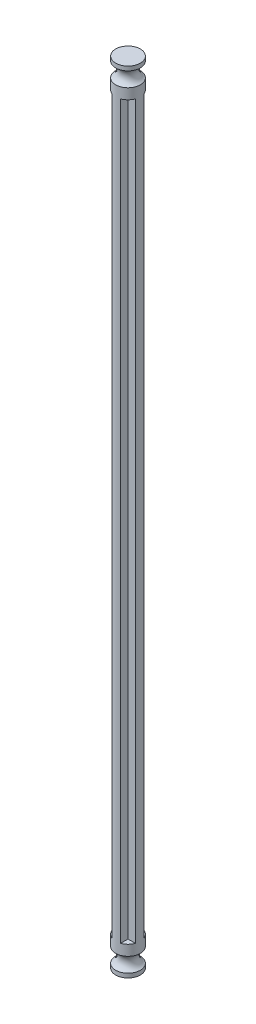
ISO-10303-21;
HEADER;
FILE_DESCRIPTION(('STEP AP214'),'2;1');
FILE_NAME('part.step','',(''),(''),'','','');
FILE_SCHEMA(('AUTOMOTIVE_DESIGN { 1 0 10303 214 1 1 1 1 }'));
ENDSEC;
DATA;
#1=APPLICATION_CONTEXT('core data for automotive mechanical design processes');
#2=APPLICATION_PROTOCOL_DEFINITION('international standard','automotive_design',2000,#1);
#3=PRODUCT_CONTEXT('',#1,'mechanical');
#4=PRODUCT('Part','Part','',(#3));
#5=PRODUCT_RELATED_PRODUCT_CATEGORY('part','',(#4));
#6=PRODUCT_DEFINITION_FORMATION('','',#4);
#7=PRODUCT_DEFINITION_CONTEXT('part definition',#1,'design');
#8=PRODUCT_DEFINITION('design','',#6,#7);
#9=PRODUCT_DEFINITION_SHAPE('','',#8);
#10=(LENGTH_UNIT() NAMED_UNIT(*) SI_UNIT(.MILLI.,.METRE.));
#11=(NAMED_UNIT(*) PLANE_ANGLE_UNIT() SI_UNIT($,.RADIAN.));
#12=(NAMED_UNIT(*) SI_UNIT($,.STERADIAN.) SOLID_ANGLE_UNIT());
#13=UNCERTAINTY_MEASURE_WITH_UNIT(LENGTH_MEASURE(1.E-05),#10,'distance_accuracy_value','');
#14=(GEOMETRIC_REPRESENTATION_CONTEXT(3) GLOBAL_UNCERTAINTY_ASSIGNED_CONTEXT((#13)) GLOBAL_UNIT_ASSIGNED_CONTEXT((#10,
#11,#12)) REPRESENTATION_CONTEXT('',''));
#15=CARTESIAN_POINT('',(0.,0.,0.));
#16=DIRECTION('',(0.,0.,1.));
#17=DIRECTION('',(1.,0.,0.));
#18=AXIS2_PLACEMENT_3D('',#15,#16,#17);
#19=CARTESIAN_POINT('',(1.,175.28,1.));
#20=DIRECTION('',(-1.,0.,0.));
#21=DIRECTION('',(0.,0.,1.));
#22=AXIS2_PLACEMENT_3D('',#19,#20,#21);
#23=PLANE('',#22);
#24=DIRECTION('',(0.,0.,-1.));
#25=VECTOR('',#24,1.);
#26=CARTESIAN_POINT('',(1.,0.,1.));
#27=LINE('',#26,#25);
#28=CARTESIAN_POINT('',(1.,0.,2.77533781727558));
#29=VERTEX_POINT('',#28);
#30=CARTESIAN_POINT('',(1.,0.,1.));
#31=VERTEX_POINT('',#30);
#32=EDGE_CURVE('E122',#29,#31,#27,.T.);
#33=ORIENTED_EDGE('',*,*,#32,.T.);
#34=DIRECTION('',(0.,-1.,0.));
#35=VECTOR('',#34,1.);
#36=CARTESIAN_POINT('',(1.,175.28,1.));
#37=LINE('',#36,#35);
#38=CARTESIAN_POINT('',(1.,175.28,1.));
#39=VERTEX_POINT('',#38);
#40=EDGE_CURVE('E11',#39,#31,#37,.T.);
#41=ORIENTED_EDGE('',*,*,#40,.F.);
#42=DIRECTION('',(0.,0.,-1.));
#43=VECTOR('',#42,1.);
#44=CARTESIAN_POINT('',(1.,175.28,1.));
#45=LINE('',#44,#43);
#46=CARTESIAN_POINT('',(0.999999999999999,175.28,2.77533781727558));
#47=VERTEX_POINT('',#46);
#48=EDGE_CURVE('E139',#47,#39,#45,.T.);
#49=ORIENTED_EDGE('',*,*,#48,.F.);
#50=DIRECTION('',(0.,-1.,0.));
#51=VECTOR('',#50,1.);
#52=CARTESIAN_POINT('',(0.999999999999999,175.28,2.77533781727558));
#53=LINE('',#52,#51);
#54=EDGE_CURVE('E52',#47,#29,#53,.T.);
#55=ORIENTED_EDGE('',*,*,#54,.T.);
#56=EDGE_LOOP('',(#33,#41,#49,#55));
#57=FACE_BOUND('',#56,.T.);
#58=ADVANCED_FACE('F37',(#57),#23,.F.);
#59=CARTESIAN_POINT('',(1.,175.28,1.));
#60=DIRECTION('',(0.,0.,-1.));
#61=DIRECTION('',(-1.,0.,0.));
#62=AXIS2_PLACEMENT_3D('',#59,#60,#61);
#63=PLANE('',#62);
#64=DIRECTION('',(1.,0.,0.));
#65=VECTOR('',#64,1.);
#66=CARTESIAN_POINT('',(1.,0.,1.));
#67=LINE('',#66,#65);
#68=CARTESIAN_POINT('',(2.77533781727558,0.,1.));
#69=VERTEX_POINT('',#68);
#70=EDGE_CURVE('E126',#31,#69,#67,.T.);
#71=ORIENTED_EDGE('',*,*,#70,.T.);
#72=DIRECTION('',(0.,-1.,0.));
#73=VECTOR('',#72,1.);
#74=CARTESIAN_POINT('',(2.77533781727558,175.28,1.));
#75=LINE('',#74,#73);
#76=CARTESIAN_POINT('',(2.77533781727558,175.28,1.));
#77=VERTEX_POINT('',#76);
#78=EDGE_CURVE('E45',#77,#69,#75,.T.);
#79=ORIENTED_EDGE('',*,*,#78,.F.);
#80=DIRECTION('',(1.,0.,0.));
#81=VECTOR('',#80,1.);
#82=CARTESIAN_POINT('',(1.,175.28,1.));
#83=LINE('',#82,#81);
#84=EDGE_CURVE('E213',#39,#77,#83,.T.);
#85=ORIENTED_EDGE('',*,*,#84,.F.);
#86=ORIENTED_EDGE('',*,*,#40,.T.);
#87=EDGE_LOOP('',(#71,#79,#85,#86));
#88=FACE_BOUND('',#87,.T.);
#89=ADVANCED_FACE('F277',(#88),#63,.F.);
#90=CARTESIAN_POINT('',(1.,175.28,-1.));
#91=DIRECTION('',(0.,0.,1.));
#92=DIRECTION('',(1.,0.,0.));
#93=AXIS2_PLACEMENT_3D('',#90,#91,#92);
#94=PLANE('',#93);
#95=DIRECTION('',(-1.,0.,0.));
#96=VECTOR('',#95,1.);
#97=CARTESIAN_POINT('',(1.,0.,-1.));
#98=LINE('',#97,#96);
#99=CARTESIAN_POINT('',(2.77533781727558,0.,-1.));
#100=VERTEX_POINT('',#99);
#101=CARTESIAN_POINT('',(1.,0.,-1.));
#102=VERTEX_POINT('',#101);
#103=EDGE_CURVE('E180',#100,#102,#98,.T.);
#104=ORIENTED_EDGE('',*,*,#103,.T.);
#105=DIRECTION('',(0.,-1.,0.));
#106=VECTOR('',#105,1.);
#107=CARTESIAN_POINT('',(1.,175.28,-1.));
#108=LINE('',#107,#106);
#109=CARTESIAN_POINT('',(1.,175.28,-1.));
#110=VERTEX_POINT('',#109);
#111=EDGE_CURVE('E171',#110,#102,#108,.T.);
#112=ORIENTED_EDGE('',*,*,#111,.F.);
#113=DIRECTION('',(-1.,0.,0.));
#114=VECTOR('',#113,1.);
#115=CARTESIAN_POINT('',(1.,175.28,-1.));
#116=LINE('',#115,#114);
#117=CARTESIAN_POINT('',(2.77533781727558,175.28,-1.));
#118=VERTEX_POINT('',#117);
#119=EDGE_CURVE('E182',#118,#110,#116,.T.);
#120=ORIENTED_EDGE('',*,*,#119,.F.);
#121=DIRECTION('',(0.,-1.,0.));
#122=VECTOR('',#121,1.);
#123=CARTESIAN_POINT('',(2.77533781727558,175.28,-1.));
#124=LINE('',#123,#122);
#125=EDGE_CURVE('E174',#118,#100,#124,.T.);
#126=ORIENTED_EDGE('',*,*,#125,.T.);
#127=EDGE_LOOP('',(#104,#112,#120,#126));
#128=FACE_BOUND('',#127,.T.);
#129=ADVANCED_FACE('F179',(#128),#94,.F.);
#130=CARTESIAN_POINT('',(1.,175.28,-1.));
#131=DIRECTION('',(-1.,0.,0.));
#132=DIRECTION('',(0.,0.,1.));
#133=AXIS2_PLACEMENT_3D('',#130,#131,#132);
#134=PLANE('',#133);
#135=DIRECTION('',(0.,0.,-1.));
#136=VECTOR('',#135,1.);
#137=CARTESIAN_POINT('',(1.,0.,-1.));
#138=LINE('',#137,#136);
#139=CARTESIAN_POINT('',(0.999999999999999,0.,-2.77533781727558));
#140=VERTEX_POINT('',#139);
#141=EDGE_CURVE('E230',#102,#140,#138,.T.);
#142=ORIENTED_EDGE('',*,*,#141,.T.);
#143=DIRECTION('',(0.,-1.,0.));
#144=VECTOR('',#143,1.);
#145=CARTESIAN_POINT('',(1.,175.28,-2.77533781727558));
#146=LINE('',#145,#144);
#147=CARTESIAN_POINT('',(1.,175.28,-2.77533781727558));
#148=VERTEX_POINT('',#147);
#149=EDGE_CURVE('E168',#148,#140,#146,.T.);
#150=ORIENTED_EDGE('',*,*,#149,.F.);
#151=DIRECTION('',(0.,0.,-1.));
#152=VECTOR('',#151,1.);
#153=CARTESIAN_POINT('',(1.,175.28,-1.));
#154=LINE('',#153,#152);
#155=EDGE_CURVE('E217',#110,#148,#154,.T.);
#156=ORIENTED_EDGE('',*,*,#155,.F.);
#157=ORIENTED_EDGE('',*,*,#111,.T.);
#158=EDGE_LOOP('',(#142,#150,#156,#157));
#159=FACE_BOUND('',#158,.T.);
#160=ADVANCED_FACE('F266',(#159),#134,.F.);
#161=CARTESIAN_POINT('',(-1.,175.28,-1.));
#162=DIRECTION('',(1.,0.,0.));
#163=DIRECTION('',(0.,0.,-1.));
#164=AXIS2_PLACEMENT_3D('',#161,#162,#163);
#165=PLANE('',#164);
#166=DIRECTION('',(0.,0.,1.));
#167=VECTOR('',#166,1.);
#168=CARTESIAN_POINT('',(-1.,0.,-1.));
#169=LINE('',#168,#167);
#170=CARTESIAN_POINT('',(-1.,0.,-2.77533781727558));
#171=VERTEX_POINT('',#170);
#172=CARTESIAN_POINT('',(-1.,0.,-1.));
#173=VERTEX_POINT('',#172);
#174=EDGE_CURVE('E232',#171,#173,#169,.T.);
#175=ORIENTED_EDGE('',*,*,#174,.T.);
#176=DIRECTION('',(0.,-1.,0.));
#177=VECTOR('',#176,1.);
#178=CARTESIAN_POINT('',(-1.,175.28,-1.));
#179=LINE('',#178,#177);
#180=CARTESIAN_POINT('',(-1.,175.28,-1.));
#181=VERTEX_POINT('',#180);
#182=EDGE_CURVE('E162',#181,#173,#179,.T.);
#183=ORIENTED_EDGE('',*,*,#182,.F.);
#184=DIRECTION('',(0.,0.,1.));
#185=VECTOR('',#184,1.);
#186=CARTESIAN_POINT('',(-1.,175.28,-1.));
#187=LINE('',#186,#185);
#188=CARTESIAN_POINT('',(-1.,175.28,-2.77533781727558));
#189=VERTEX_POINT('',#188);
#190=EDGE_CURVE('E220',#189,#181,#187,.T.);
#191=ORIENTED_EDGE('',*,*,#190,.F.);
#192=DIRECTION('',(0.,-1.,0.));
#193=VECTOR('',#192,1.);
#194=CARTESIAN_POINT('',(-1.,175.28,-2.77533781727558));
#195=LINE('',#194,#193);
#196=EDGE_CURVE('E165',#189,#171,#195,.T.);
#197=ORIENTED_EDGE('',*,*,#196,.T.);
#198=EDGE_LOOP('',(#175,#183,#191,#197));
#199=FACE_BOUND('',#198,.T.);
#200=ADVANCED_FACE('F264',(#199),#165,.F.);
#201=CARTESIAN_POINT('',(-1.,175.28,-1.));
#202=DIRECTION('',(0.,0.,1.));
#203=DIRECTION('',(1.,0.,0.));
#204=AXIS2_PLACEMENT_3D('',#201,#202,#203);
#205=PLANE('',#204);
#206=DIRECTION('',(-1.,0.,0.));
#207=VECTOR('',#206,1.);
#208=CARTESIAN_POINT('',(-1.,0.,-1.));
#209=LINE('',#208,#207);
#210=CARTESIAN_POINT('',(-2.77533781727558,0.,-1.));
#211=VERTEX_POINT('',#210);
#212=EDGE_CURVE('E235',#173,#211,#209,.T.);
#213=ORIENTED_EDGE('',*,*,#212,.T.);
#214=DIRECTION('',(0.,-1.,0.));
#215=VECTOR('',#214,1.);
#216=CARTESIAN_POINT('',(-2.77533781727558,175.28,-1.));
#217=LINE('',#216,#215);
#218=CARTESIAN_POINT('',(-2.77533781727558,175.28,-1.));
#219=VERTEX_POINT('',#218);
#220=EDGE_CURVE('E159',#219,#211,#217,.T.);
#221=ORIENTED_EDGE('',*,*,#220,.F.);
#222=DIRECTION('',(-1.,0.,0.));
#223=VECTOR('',#222,1.);
#224=CARTESIAN_POINT('',(-1.,175.28,-1.));
#225=LINE('',#224,#223);
#226=EDGE_CURVE('E223',#181,#219,#225,.T.);
#227=ORIENTED_EDGE('',*,*,#226,.F.);
#228=ORIENTED_EDGE('',*,*,#182,.T.);
#229=EDGE_LOOP('',(#213,#221,#227,#228));
#230=FACE_BOUND('',#229,.T.);
#231=ADVANCED_FACE('F260',(#230),#205,.F.);
#232=CARTESIAN_POINT('',(-1.,175.28,1.));
#233=DIRECTION('',(0.,0.,-1.));
#234=DIRECTION('',(-1.,0.,0.));
#235=AXIS2_PLACEMENT_3D('',#232,#233,#234);
#236=PLANE('',#235);
#237=DIRECTION('',(1.,0.,0.));
#238=VECTOR('',#237,1.);
#239=CARTESIAN_POINT('',(-1.,0.,1.));
#240=LINE('',#239,#238);
#241=CARTESIAN_POINT('',(-2.77533781727558,0.,1.));
#242=VERTEX_POINT('',#241);
#243=CARTESIAN_POINT('',(-1.,0.,1.));
#244=VERTEX_POINT('',#243);
#245=EDGE_CURVE('E237',#242,#244,#240,.T.);
#246=ORIENTED_EDGE('',*,*,#245,.T.);
#247=DIRECTION('',(0.,-1.,0.));
#248=VECTOR('',#247,1.);
#249=CARTESIAN_POINT('',(-1.,175.28,1.));
#250=LINE('',#249,#248);
#251=CARTESIAN_POINT('',(-1.,175.28,1.));
#252=VERTEX_POINT('',#251);
#253=EDGE_CURVE('E145',#252,#244,#250,.T.);
#254=ORIENTED_EDGE('',*,*,#253,.F.);
#255=DIRECTION('',(1.,0.,0.));
#256=VECTOR('',#255,1.);
#257=CARTESIAN_POINT('',(-1.,175.28,1.));
#258=LINE('',#257,#256);
#259=CARTESIAN_POINT('',(-2.77533781727558,175.28,0.999999999999999));
#260=VERTEX_POINT('',#259);
#261=EDGE_CURVE('E148',#260,#252,#258,.T.);
#262=ORIENTED_EDGE('',*,*,#261,.F.);
#263=DIRECTION('',(0.,-1.,0.));
#264=VECTOR('',#263,1.);
#265=CARTESIAN_POINT('',(-2.77533781727558,175.28,0.999999999999999));
#266=LINE('',#265,#264);
#267=EDGE_CURVE('E156',#260,#242,#266,.T.);
#268=ORIENTED_EDGE('',*,*,#267,.T.);
#269=EDGE_LOOP('',(#246,#254,#262,#268));
#270=FACE_BOUND('',#269,.T.);
#271=ADVANCED_FACE('F272',(#270),#236,.F.);
#272=CARTESIAN_POINT('',(-1.,175.28,1.));
#273=DIRECTION('',(1.,0.,0.));
#274=DIRECTION('',(0.,0.,-1.));
#275=AXIS2_PLACEMENT_3D('',#272,#273,#274);
#276=PLANE('',#275);
#277=DIRECTION('',(0.,0.,1.));
#278=VECTOR('',#277,1.);
#279=CARTESIAN_POINT('',(-1.,0.,1.));
#280=LINE('',#279,#278);
#281=CARTESIAN_POINT('',(-0.999999999999999,0.,2.77533781727558));
#282=VERTEX_POINT('',#281);
#283=EDGE_CURVE('E151',#244,#282,#280,.T.);
#284=ORIENTED_EDGE('',*,*,#283,.T.);
#285=DIRECTION('',(0.,-1.,0.));
#286=VECTOR('',#285,1.);
#287=CARTESIAN_POINT('',(-1.,175.28,2.77533781727558));
#288=LINE('',#287,#286);
#289=CARTESIAN_POINT('',(-0.999999999999999,175.28,2.77533781727563));
#290=VERTEX_POINT('',#289);
#291=EDGE_CURVE('E141',#290,#282,#288,.T.);
#292=ORIENTED_EDGE('',*,*,#291,.F.);
#293=DIRECTION('',(0.,0.,1.));
#294=VECTOR('',#293,1.);
#295=CARTESIAN_POINT('',(-1.,175.28,1.));
#296=LINE('',#295,#294);
#297=EDGE_CURVE('E142',#252,#290,#296,.T.);
#298=ORIENTED_EDGE('',*,*,#297,.F.);
#299=ORIENTED_EDGE('',*,*,#253,.T.);
#300=EDGE_LOOP('',(#284,#292,#298,#299));
#301=FACE_BOUND('',#300,.T.);
#302=ADVANCED_FACE('F242',(#301),#276,.F.);
#303=CARTESIAN_POINT('',(0.,175.28,0.));
#304=DIRECTION('',(0.,-1.,0.));
#305=DIRECTION('',(0.,0.,-1.));
#306=AXIS2_PLACEMENT_3D('',#303,#304,#305);
#307=CYLINDRICAL_SURFACE('',#306,2.95);
#308=CARTESIAN_POINT('',(0.,0.,0.));
#309=DIRECTION('',(0.,1.,0.));
#310=DIRECTION('',(0.,0.,1.));
#311=AXIS2_PLACEMENT_3D('',#308,#309,#310);
#312=CIRCLE('',#311,2.95);
#313=EDGE_CURVE('E124',#29,#69,#312,.T.);
#314=ORIENTED_EDGE('',*,*,#313,.F.);
#315=ORIENTED_EDGE('',*,*,#54,.F.);
#316=CARTESIAN_POINT('',(0.,175.28,0.));
#317=DIRECTION('',(0.,1.,0.));
#318=DIRECTION('',(0.,0.,1.));
#319=AXIS2_PLACEMENT_3D('',#316,#317,#318);
#320=CIRCLE('',#319,2.95000000000002);
#321=EDGE_CURVE('E129',#47,#77,#320,.T.);
#322=ORIENTED_EDGE('',*,*,#321,.T.);
#323=ORIENTED_EDGE('',*,*,#78,.T.);
#324=EDGE_LOOP('',(#314,#315,#322,#323));
#325=FACE_BOUND('',#324,.T.);
#326=EDGE_CURVE('E137',#242,#282,#312,.T.);
#327=ORIENTED_EDGE('',*,*,#326,.F.);
#328=ORIENTED_EDGE('',*,*,#267,.F.);
#329=EDGE_CURVE('E210',#260,#290,#320,.T.);
#330=ORIENTED_EDGE('',*,*,#329,.T.);
#331=ORIENTED_EDGE('',*,*,#291,.T.);
#332=EDGE_LOOP('',(#327,#328,#330,#331));
#333=FACE_BOUND('',#332,.T.);
#334=EDGE_CURVE('E191',#171,#211,#312,.T.);
#335=ORIENTED_EDGE('',*,*,#334,.F.);
#336=ORIENTED_EDGE('',*,*,#196,.F.);
#337=EDGE_CURVE('E251',#189,#219,#320,.T.);
#338=ORIENTED_EDGE('',*,*,#337,.T.);
#339=ORIENTED_EDGE('',*,*,#220,.T.);
#340=EDGE_LOOP('',(#335,#336,#338,#339));
#341=FACE_BOUND('',#340,.T.);
#342=ORIENTED_EDGE('',*,*,#149,.T.);
#343=EDGE_CURVE('E135',#100,#140,#312,.T.);
#344=ORIENTED_EDGE('',*,*,#343,.F.);
#345=ORIENTED_EDGE('',*,*,#125,.F.);
#346=EDGE_CURVE('E188',#118,#148,#320,.T.);
#347=ORIENTED_EDGE('',*,*,#346,.T.);
#348=EDGE_LOOP('',(#342,#344,#345,#347));
#349=FACE_BOUND('',#348,.T.);
#350=CARTESIAN_POINT('',(0.,177.78,0.));
#351=DIRECTION('',(0.,1.,0.));
#352=DIRECTION('',(0.,0.,1.));
#353=AXIS2_PLACEMENT_3D('',#350,#351,#352);
#354=CIRCLE('',#353,2.95000000000002);
#355=CARTESIAN_POINT('',(0.,177.78,2.95000000000004));
#356=VERTEX_POINT('',#355);
#357=EDGE_CURVE('E207',#356,#356,#354,.T.);
#358=ORIENTED_EDGE('',*,*,#357,.F.);
#359=EDGE_LOOP('',(#358));
#360=FACE_BOUND('',#359,.T.);
#361=CARTESIAN_POINT('',(0.,-2.5,0.));
#362=DIRECTION('',(0.,1.,0.));
#363=DIRECTION('',(0.,0.,1.));
#364=AXIS2_PLACEMENT_3D('',#361,#362,#363);
#365=CIRCLE('',#364,2.95);
#366=CARTESIAN_POINT('',(0.,-2.5,2.95));
#367=VERTEX_POINT('',#366);
#368=EDGE_CURVE('E134',#367,#367,#365,.T.);
#369=ORIENTED_EDGE('',*,*,#368,.T.);
#370=EDGE_LOOP('',(#369));
#371=FACE_BOUND('',#370,.T.);
#372=ADVANCED_FACE('F132',(#325,#333,#341,#349,#360,#371),#307,.T.);
#373=CARTESIAN_POINT('',(0.,175.28,0.));
#374=DIRECTION('',(0.,1.,0.));
#375=DIRECTION('',(0.,0.,1.));
#376=AXIS2_PLACEMENT_3D('',#373,#374,#375);
#377=PLANE('',#376);
#378=ORIENTED_EDGE('',*,*,#321,.F.);
#379=ORIENTED_EDGE('',*,*,#48,.T.);
#380=ORIENTED_EDGE('',*,*,#84,.T.);
#381=EDGE_LOOP('',(#378,#379,#380));
#382=FACE_BOUND('',#381,.T.);
#383=ADVANCED_FACE('F287',(#382),#377,.F.);
#384=ORIENTED_EDGE('',*,*,#346,.F.);
#385=ORIENTED_EDGE('',*,*,#119,.T.);
#386=ORIENTED_EDGE('',*,*,#155,.T.);
#387=EDGE_LOOP('',(#384,#385,#386));
#388=FACE_BOUND('',#387,.T.);
#389=ADVANCED_FACE('F289',(#388),#377,.F.);
#390=ORIENTED_EDGE('',*,*,#337,.F.);
#391=ORIENTED_EDGE('',*,*,#190,.T.);
#392=ORIENTED_EDGE('',*,*,#226,.T.);
#393=EDGE_LOOP('',(#390,#391,#392));
#394=FACE_BOUND('',#393,.T.);
#395=ADVANCED_FACE('F257',(#394),#377,.F.);
#396=ORIENTED_EDGE('',*,*,#329,.F.);
#397=ORIENTED_EDGE('',*,*,#261,.T.);
#398=ORIENTED_EDGE('',*,*,#297,.T.);
#399=EDGE_LOOP('',(#396,#397,#398));
#400=FACE_BOUND('',#399,.T.);
#401=ADVANCED_FACE('F291',(#400),#377,.F.);
#402=CARTESIAN_POINT('',(0.,179.53,0.));
#403=DIRECTION('',(0.,1.,0.));
#404=DIRECTION('',(0.,0.,1.));
#405=AXIS2_PLACEMENT_3D('',#402,#403,#404);
#406=TOROIDAL_SURFACE('',#405,3.91824583655187,2.);
#407=CARTESIAN_POINT('',(0.,181.28,0.));
#408=DIRECTION('',(0.,1.,0.));
#409=DIRECTION('',(0.,0.,1.));
#410=AXIS2_PLACEMENT_3D('',#407,#408,#409);
#411=CIRCLE('',#410,2.95000000000002);
#412=CARTESIAN_POINT('',(0.,181.28,2.95000000000004));
#413=VERTEX_POINT('',#412);
#414=EDGE_CURVE('E204',#413,#413,#411,.T.);
#415=ORIENTED_EDGE('',*,*,#414,.F.);
#416=EDGE_LOOP('',(#415));
#417=FACE_BOUND('',#416,.T.);
#418=ORIENTED_EDGE('',*,*,#357,.T.);
#419=EDGE_LOOP('',(#418));
#420=FACE_BOUND('',#419,.T.);
#421=ADVANCED_FACE('F300',(#417,#420),#406,.F.);
#422=CARTESIAN_POINT('',(0.,0.,0.));
#423=DIRECTION('',(0.,1.,0.));
#424=DIRECTION('',(0.,0.,1.));
#425=AXIS2_PLACEMENT_3D('',#422,#423,#424);
#426=CYLINDRICAL_SURFACE('',#425,2.95000000000002);
#427=CARTESIAN_POINT('',(0.,182.28,0.));
#428=DIRECTION('',(0.,1.,0.));
#429=DIRECTION('',(0.,0.,1.));
#430=AXIS2_PLACEMENT_3D('',#427,#428,#429);
#431=CIRCLE('',#430,2.95000000000002);
#432=CARTESIAN_POINT('',(0.,182.28,2.95000000000004));
#433=VERTEX_POINT('',#432);
#434=EDGE_CURVE('E201',#433,#433,#431,.T.);
#435=ORIENTED_EDGE('',*,*,#434,.F.);
#436=EDGE_LOOP('',(#435));
#437=FACE_BOUND('',#436,.T.);
#438=ORIENTED_EDGE('',*,*,#414,.T.);
#439=EDGE_LOOP('',(#438));
#440=FACE_BOUND('',#439,.T.);
#441=ADVANCED_FACE('F305',(#437,#440),#426,.T.);
#442=CARTESIAN_POINT('',(0.,182.28,0.));
#443=DIRECTION('',(0.,-1.,0.));
#444=DIRECTION('',(0.,0.,-1.));
#445=AXIS2_PLACEMENT_3D('',#442,#443,#444);
#446=PLANE('',#445);
#447=ORIENTED_EDGE('',*,*,#434,.T.);
#448=EDGE_LOOP('',(#447));
#449=FACE_BOUND('',#448,.T.);
#450=ADVANCED_FACE('F405',(#449),#446,.F.);
#451=CARTESIAN_POINT('',(0.,0.,0.));
#452=DIRECTION('',(0.,-1.,0.));
#453=DIRECTION('',(0.,0.,-1.));
#454=AXIS2_PLACEMENT_3D('',#451,#452,#453);
#455=PLANE('',#454);
#456=ORIENTED_EDGE('',*,*,#283,.F.);
#457=ORIENTED_EDGE('',*,*,#245,.F.);
#458=ORIENTED_EDGE('',*,*,#326,.T.);
#459=EDGE_LOOP('',(#456,#457,#458));
#460=FACE_BOUND('',#459,.T.);
#461=ADVANCED_FACE('F414',(#460),#455,.F.);
#462=ORIENTED_EDGE('',*,*,#212,.F.);
#463=ORIENTED_EDGE('',*,*,#174,.F.);
#464=ORIENTED_EDGE('',*,*,#334,.T.);
#465=EDGE_LOOP('',(#462,#463,#464));
#466=FACE_BOUND('',#465,.T.);
#467=ADVANCED_FACE('F262',(#466),#455,.F.);
#468=ORIENTED_EDGE('',*,*,#141,.F.);
#469=ORIENTED_EDGE('',*,*,#103,.F.);
#470=ORIENTED_EDGE('',*,*,#343,.T.);
#471=EDGE_LOOP('',(#468,#469,#470));
#472=FACE_BOUND('',#471,.T.);
#473=ADVANCED_FACE('F430',(#472),#455,.F.);
#474=ORIENTED_EDGE('',*,*,#32,.F.);
#475=ORIENTED_EDGE('',*,*,#313,.T.);
#476=ORIENTED_EDGE('',*,*,#70,.F.);
#477=EDGE_LOOP('',(#474,#475,#476));
#478=FACE_BOUND('',#477,.T.);
#479=ADVANCED_FACE('F123',(#478),#455,.F.);
#480=CARTESIAN_POINT('',(0.,-7.,0.));
#481=DIRECTION('',(0.,1.,0.));
#482=DIRECTION('',(0.,0.,1.));
#483=AXIS2_PLACEMENT_3D('',#480,#481,#482);
#484=PLANE('',#483);
#485=CARTESIAN_POINT('',(0.,-7.,0.));
#486=DIRECTION('',(0.,1.,0.));
#487=DIRECTION('',(0.,0.,1.));
#488=AXIS2_PLACEMENT_3D('',#485,#486,#487);
#489=CIRCLE('',#488,2.95);
#490=CARTESIAN_POINT('',(0.,-7.,2.95));
#491=VERTEX_POINT('',#490);
#492=EDGE_CURVE('E198',#491,#491,#489,.T.);
#493=ORIENTED_EDGE('',*,*,#492,.F.);
#494=EDGE_LOOP('',(#493));
#495=FACE_BOUND('',#494,.T.);
#496=ADVANCED_FACE('F443',(#495),#484,.F.);
#497=CARTESIAN_POINT('',(0.,0.,0.));
#498=DIRECTION('',(0.,1.,0.));
#499=DIRECTION('',(0.,0.,1.));
#500=AXIS2_PLACEMENT_3D('',#497,#498,#499);
#501=CYLINDRICAL_SURFACE('',#500,2.95);
#502=CARTESIAN_POINT('',(0.,-6.,0.));
#503=DIRECTION('',(0.,1.,0.));
#504=DIRECTION('',(0.,0.,1.));
#505=AXIS2_PLACEMENT_3D('',#502,#503,#504);
#506=CIRCLE('',#505,2.95);
#507=CARTESIAN_POINT('',(0.,-6.,2.95));
#508=VERTEX_POINT('',#507);
#509=EDGE_CURVE('E195',#508,#508,#506,.T.);
#510=ORIENTED_EDGE('',*,*,#509,.F.);
#511=EDGE_LOOP('',(#510));
#512=FACE_BOUND('',#511,.T.);
#513=ORIENTED_EDGE('',*,*,#492,.T.);
#514=EDGE_LOOP('',(#513));
#515=FACE_BOUND('',#514,.T.);
#516=ADVANCED_FACE('F450',(#512,#515),#501,.T.);
#517=CARTESIAN_POINT('',(0.,-4.25,0.));
#518=DIRECTION('',(0.,1.,0.));
#519=DIRECTION('',(0.,0.,1.));
#520=AXIS2_PLACEMENT_3D('',#517,#518,#519);
#521=TOROIDAL_SURFACE('',#520,3.91824583655185,2.);
#522=ORIENTED_EDGE('',*,*,#368,.F.);
#523=EDGE_LOOP('',(#522));
#524=FACE_BOUND('',#523,.T.);
#525=ORIENTED_EDGE('',*,*,#509,.T.);
#526=EDGE_LOOP('',(#525));
#527=FACE_BOUND('',#526,.T.);
#528=ADVANCED_FACE('F459',(#524,#527),#521,.F.);
#529=CLOSED_SHELL('',(#58,#89,#129,#160,#200,#231,#271,#302,#372,#383,#389,#395,#401,#421,#441,
#450,#461,#467,#473,#479,#496,#516,#528));
#530=MANIFOLD_SOLID_BREP('B2',#529);
#531=ADVANCED_BREP_SHAPE_REPRESENTATION('',(#18,#530),#14);
#532=SHAPE_DEFINITION_REPRESENTATION(#9,#531);
ENDSEC;
END-ISO-10303-21;
